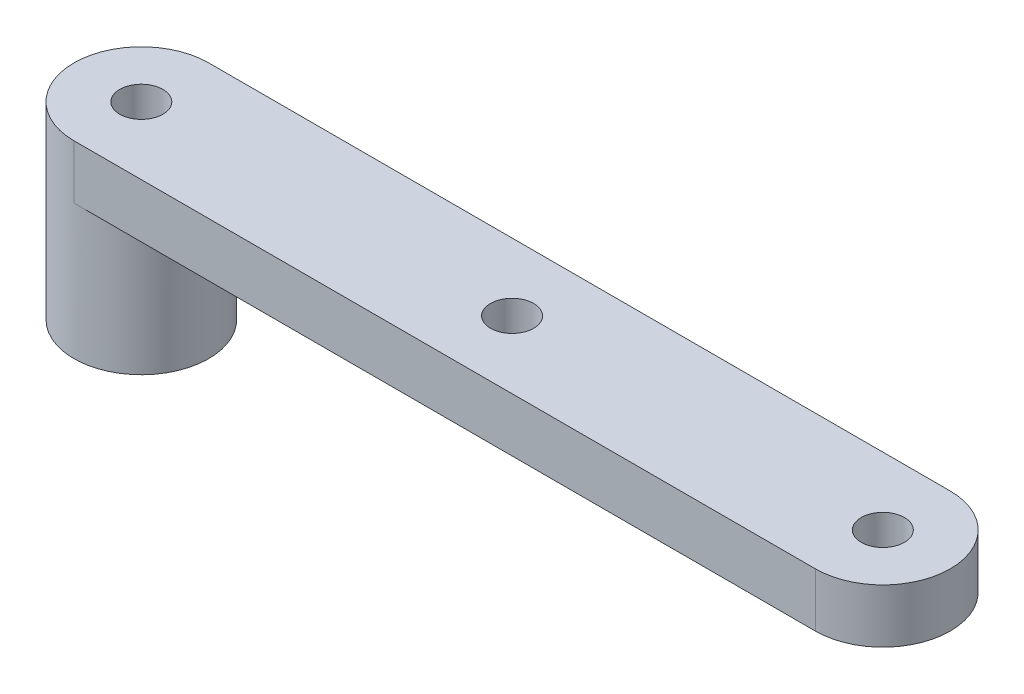
ISO-10303-21;
HEADER;
FILE_DESCRIPTION(('STEP AP214'),'2;1');
FILE_NAME('part.step','',(''),(''),'','','');
FILE_SCHEMA(('AUTOMOTIVE_DESIGN { 1 0 10303 214 1 1 1 1 }'));
ENDSEC;
DATA;
#1=APPLICATION_CONTEXT('core data for automotive mechanical design processes');
#2=APPLICATION_PROTOCOL_DEFINITION('international standard','automotive_design',2000,#1);
#3=PRODUCT_CONTEXT('',#1,'mechanical');
#4=PRODUCT('Part','Part','',(#3));
#5=PRODUCT_RELATED_PRODUCT_CATEGORY('part','',(#4));
#6=PRODUCT_DEFINITION_FORMATION('','',#4);
#7=PRODUCT_DEFINITION_CONTEXT('part definition',#1,'design');
#8=PRODUCT_DEFINITION('design','',#6,#7);
#9=PRODUCT_DEFINITION_SHAPE('','',#8);
#10=(LENGTH_UNIT() NAMED_UNIT(*) SI_UNIT(.MILLI.,.METRE.));
#11=(NAMED_UNIT(*) PLANE_ANGLE_UNIT() SI_UNIT($,.RADIAN.));
#12=(NAMED_UNIT(*) SI_UNIT($,.STERADIAN.) SOLID_ANGLE_UNIT());
#13=UNCERTAINTY_MEASURE_WITH_UNIT(LENGTH_MEASURE(1.E-05),#10,'distance_accuracy_value','');
#14=(GEOMETRIC_REPRESENTATION_CONTEXT(3) GLOBAL_UNCERTAINTY_ASSIGNED_CONTEXT((#13)) GLOBAL_UNIT_ASSIGNED_CONTEXT((#10,
#11,#12)) REPRESENTATION_CONTEXT('',''));
#15=CARTESIAN_POINT('',(0.,0.,0.));
#16=DIRECTION('',(0.,0.,1.));
#17=DIRECTION('',(1.,0.,0.));
#18=AXIS2_PLACEMENT_3D('',#15,#16,#17);
#19=CARTESIAN_POINT('',(0.,0.,0.));
#20=DIRECTION('',(0.,1.,0.));
#21=DIRECTION('',(0.,0.,1.));
#22=AXIS2_PLACEMENT_3D('',#19,#20,#21);
#23=PLANE('',#22);
#24=CARTESIAN_POINT('',(27.5,0.,0.));
#25=DIRECTION('',(0.,1.,0.));
#26=DIRECTION('',(0.,0.,1.));
#27=AXIS2_PLACEMENT_3D('',#24,#25,#26);
#28=CIRCLE('',#27,1.6);
#29=CARTESIAN_POINT('',(27.5,0.,1.6));
#30=VERTEX_POINT('',#29);
#31=EDGE_CURVE('E96',#30,#30,#28,.T.);
#32=ORIENTED_EDGE('',*,*,#31,.T.);
#33=EDGE_LOOP('',(#32));
#34=FACE_BOUND('',#33,.T.);
#35=CARTESIAN_POINT('',(55.,0.,0.));
#36=DIRECTION('',(0.,1.,0.));
#37=DIRECTION('',(0.,0.,1.));
#38=AXIS2_PLACEMENT_3D('',#35,#36,#37);
#39=CIRCLE('',#38,1.6);
#40=CARTESIAN_POINT('',(55.,0.,1.6));
#41=VERTEX_POINT('',#40);
#42=EDGE_CURVE('E134',#41,#41,#39,.T.);
#43=ORIENTED_EDGE('',*,*,#42,.T.);
#44=EDGE_LOOP('',(#43));
#45=FACE_BOUND('',#44,.T.);
#46=CARTESIAN_POINT('',(0.,0.,0.));
#47=DIRECTION('',(0.,-1.,0.));
#48=DIRECTION('',(0.,0.,-1.));
#49=AXIS2_PLACEMENT_3D('',#46,#47,#48);
#50=CIRCLE('',#49,5.);
#51=CARTESIAN_POINT('',(0.,0.,-5.));
#52=VERTEX_POINT('',#51);
#53=CARTESIAN_POINT('',(0.,0.,5.));
#54=VERTEX_POINT('',#53);
#55=EDGE_CURVE('E88',#52,#54,#50,.T.);
#56=ORIENTED_EDGE('',*,*,#55,.F.);
#57=DIRECTION('',(-1.,0.,0.));
#58=VECTOR('',#57,1.);
#59=CARTESIAN_POINT('',(0.,0.,-5.));
#60=LINE('',#59,#58);
#61=CARTESIAN_POINT('',(55.,0.,-5.));
#62=VERTEX_POINT('',#61);
#63=EDGE_CURVE('E90',#62,#52,#60,.T.);
#64=ORIENTED_EDGE('',*,*,#63,.F.);
#65=CARTESIAN_POINT('',(55.,0.,0.));
#66=DIRECTION('',(0.,1.,0.));
#67=DIRECTION('',(0.,0.,1.));
#68=AXIS2_PLACEMENT_3D('',#65,#66,#67);
#69=CIRCLE('',#68,5.);
#70=CARTESIAN_POINT('',(55.,0.,5.));
#71=VERTEX_POINT('',#70);
#72=EDGE_CURVE('E78',#71,#62,#69,.T.);
#73=ORIENTED_EDGE('',*,*,#72,.F.);
#74=DIRECTION('',(1.,0.,0.));
#75=VECTOR('',#74,1.);
#76=CARTESIAN_POINT('',(0.,0.,5.));
#77=LINE('',#76,#75);
#78=EDGE_CURVE('E71',#54,#71,#77,.T.);
#79=ORIENTED_EDGE('',*,*,#78,.F.);
#80=EDGE_LOOP('',(#56,#64,#73,#79));
#81=FACE_BOUND('',#80,.T.);
#82=ADVANCED_FACE('F39',(#34,#45,#81),#23,.F.);
#83=CARTESIAN_POINT('',(0.,4.,0.));
#84=DIRECTION('',(0.,-1.,0.));
#85=DIRECTION('',(0.,0.,-1.));
#86=AXIS2_PLACEMENT_3D('',#83,#84,#85);
#87=CYLINDRICAL_SURFACE('',#86,5.);
#88=DIRECTION('',(0.,-1.,0.));
#89=VECTOR('',#88,1.);
#90=CARTESIAN_POINT('',(0.,4.,-5.));
#91=LINE('',#90,#89);
#92=CARTESIAN_POINT('',(0.,4.,-5.));
#93=VERTEX_POINT('',#92);
#94=EDGE_CURVE('E100',#93,#52,#91,.T.);
#95=ORIENTED_EDGE('',*,*,#94,.T.);
#96=ORIENTED_EDGE('',*,*,#55,.T.);
#97=DIRECTION('',(0.,-1.,0.));
#98=VECTOR('',#97,1.);
#99=CARTESIAN_POINT('',(0.,4.,5.));
#100=LINE('',#99,#98);
#101=CARTESIAN_POINT('',(0.,4.,5.));
#102=VERTEX_POINT('',#101);
#103=EDGE_CURVE('E11',#102,#54,#100,.T.);
#104=ORIENTED_EDGE('',*,*,#103,.F.);
#105=CARTESIAN_POINT('',(0.,4.,0.));
#106=DIRECTION('',(0.,1.,0.));
#107=DIRECTION('',(0.,0.,1.));
#108=AXIS2_PLACEMENT_3D('',#105,#106,#107);
#109=CIRCLE('',#108,5.);
#110=EDGE_CURVE('E104',#93,#102,#109,.T.);
#111=ORIENTED_EDGE('',*,*,#110,.F.);
#112=EDGE_LOOP('',(#95,#96,#104,#111));
#113=FACE_BOUND('',#112,.T.);
#114=CARTESIAN_POINT('',(0.,-10.,0.));
#115=DIRECTION('',(0.,-1.,0.));
#116=DIRECTION('',(0.,0.,-1.));
#117=AXIS2_PLACEMENT_3D('',#114,#115,#116);
#118=CIRCLE('',#117,5.);
#119=CARTESIAN_POINT('',(0.,-10.,-5.));
#120=VERTEX_POINT('',#119);
#121=EDGE_CURVE('E95',#120,#120,#118,.T.);
#122=ORIENTED_EDGE('',*,*,#121,.F.);
#123=EDGE_LOOP('',(#122));
#124=FACE_BOUND('',#123,.T.);
#125=ADVANCED_FACE('F41',(#113,#124),#87,.T.);
#126=CARTESIAN_POINT('',(0.,4.,5.));
#127=DIRECTION('',(0.,0.,-1.));
#128=DIRECTION('',(-1.,0.,0.));
#129=AXIS2_PLACEMENT_3D('',#126,#127,#128);
#130=PLANE('',#129);
#131=ORIENTED_EDGE('',*,*,#78,.T.);
#132=DIRECTION('',(0.,-1.,0.));
#133=VECTOR('',#132,1.);
#134=CARTESIAN_POINT('',(55.,4.,5.));
#135=LINE('',#134,#133);
#136=CARTESIAN_POINT('',(55.,4.,5.));
#137=VERTEX_POINT('',#136);
#138=EDGE_CURVE('E49',#137,#71,#135,.T.);
#139=ORIENTED_EDGE('',*,*,#138,.F.);
#140=DIRECTION('',(1.,0.,0.));
#141=VECTOR('',#140,1.);
#142=CARTESIAN_POINT('',(0.,4.,5.));
#143=LINE('',#142,#141);
#144=EDGE_CURVE('E83',#102,#137,#143,.T.);
#145=ORIENTED_EDGE('',*,*,#144,.F.);
#146=ORIENTED_EDGE('',*,*,#103,.T.);
#147=EDGE_LOOP('',(#131,#139,#145,#146));
#148=FACE_BOUND('',#147,.T.);
#149=ADVANCED_FACE('F172',(#148),#130,.F.);
#150=CARTESIAN_POINT('',(55.,4.,0.));
#151=DIRECTION('',(0.,-1.,0.));
#152=DIRECTION('',(0.,0.,-1.));
#153=AXIS2_PLACEMENT_3D('',#150,#151,#152);
#154=CYLINDRICAL_SURFACE('',#153,5.);
#155=ORIENTED_EDGE('',*,*,#72,.T.);
#156=DIRECTION('',(0.,-1.,0.));
#157=VECTOR('',#156,1.);
#158=CARTESIAN_POINT('',(55.,4.,-5.));
#159=LINE('',#158,#157);
#160=CARTESIAN_POINT('',(55.,4.,-5.));
#161=VERTEX_POINT('',#160);
#162=EDGE_CURVE('E102',#161,#62,#159,.T.);
#163=ORIENTED_EDGE('',*,*,#162,.F.);
#164=CARTESIAN_POINT('',(55.,4.,0.));
#165=DIRECTION('',(0.,1.,0.));
#166=DIRECTION('',(0.,0.,1.));
#167=AXIS2_PLACEMENT_3D('',#164,#165,#166);
#168=CIRCLE('',#167,5.);
#169=EDGE_CURVE('E112',#137,#161,#168,.T.);
#170=ORIENTED_EDGE('',*,*,#169,.F.);
#171=ORIENTED_EDGE('',*,*,#138,.T.);
#172=EDGE_LOOP('',(#155,#163,#170,#171));
#173=FACE_BOUND('',#172,.T.);
#174=ADVANCED_FACE('F117',(#173),#154,.T.);
#175=CARTESIAN_POINT('',(0.,4.,-5.));
#176=DIRECTION('',(0.,0.,1.));
#177=DIRECTION('',(1.,0.,0.));
#178=AXIS2_PLACEMENT_3D('',#175,#176,#177);
#179=PLANE('',#178);
#180=ORIENTED_EDGE('',*,*,#63,.T.);
#181=ORIENTED_EDGE('',*,*,#94,.F.);
#182=DIRECTION('',(-1.,0.,0.));
#183=VECTOR('',#182,1.);
#184=CARTESIAN_POINT('',(0.,4.,-5.));
#185=LINE('',#184,#183);
#186=EDGE_CURVE('E57',#161,#93,#185,.T.);
#187=ORIENTED_EDGE('',*,*,#186,.F.);
#188=ORIENTED_EDGE('',*,*,#162,.T.);
#189=EDGE_LOOP('',(#180,#181,#187,#188));
#190=FACE_BOUND('',#189,.T.);
#191=ADVANCED_FACE('F99',(#190),#179,.F.);
#192=CARTESIAN_POINT('',(0.,4.,0.));
#193=DIRECTION('',(0.,1.,0.));
#194=DIRECTION('',(0.,0.,1.));
#195=AXIS2_PLACEMENT_3D('',#192,#193,#194);
#196=PLANE('',#195);
#197=CARTESIAN_POINT('',(0.,4.,0.));
#198=DIRECTION('',(0.,1.,0.));
#199=DIRECTION('',(0.,0.,1.));
#200=AXIS2_PLACEMENT_3D('',#197,#198,#199);
#201=CIRCLE('',#200,1.6);
#202=CARTESIAN_POINT('',(0.,4.,1.6));
#203=VERTEX_POINT('',#202);
#204=EDGE_CURVE('E147',#203,#203,#201,.T.);
#205=ORIENTED_EDGE('',*,*,#204,.F.);
#206=EDGE_LOOP('',(#205));
#207=FACE_BOUND('',#206,.T.);
#208=CARTESIAN_POINT('',(27.5,4.,0.));
#209=DIRECTION('',(0.,1.,0.));
#210=DIRECTION('',(0.,0.,1.));
#211=AXIS2_PLACEMENT_3D('',#208,#209,#210);
#212=CIRCLE('',#211,1.6);
#213=CARTESIAN_POINT('',(27.5,4.,1.6));
#214=VERTEX_POINT('',#213);
#215=EDGE_CURVE('E143',#214,#214,#212,.T.);
#216=ORIENTED_EDGE('',*,*,#215,.F.);
#217=EDGE_LOOP('',(#216));
#218=FACE_BOUND('',#217,.T.);
#219=CARTESIAN_POINT('',(55.,4.,0.));
#220=DIRECTION('',(0.,1.,0.));
#221=DIRECTION('',(0.,0.,1.));
#222=AXIS2_PLACEMENT_3D('',#219,#220,#221);
#223=CIRCLE('',#222,1.6);
#224=CARTESIAN_POINT('',(55.,4.,1.6));
#225=VERTEX_POINT('',#224);
#226=EDGE_CURVE('E139',#225,#225,#223,.T.);
#227=ORIENTED_EDGE('',*,*,#226,.F.);
#228=EDGE_LOOP('',(#227));
#229=FACE_BOUND('',#228,.T.);
#230=ORIENTED_EDGE('',*,*,#110,.T.);
#231=ORIENTED_EDGE('',*,*,#144,.T.);
#232=ORIENTED_EDGE('',*,*,#169,.T.);
#233=ORIENTED_EDGE('',*,*,#186,.T.);
#234=EDGE_LOOP('',(#230,#231,#232,#233));
#235=FACE_BOUND('',#234,.T.);
#236=ADVANCED_FACE('F165',(#207,#218,#229,#235),#196,.T.);
#237=CARTESIAN_POINT('',(0.,-10.,0.));
#238=DIRECTION('',(0.,-1.,0.));
#239=DIRECTION('',(0.,0.,-1.));
#240=AXIS2_PLACEMENT_3D('',#237,#238,#239);
#241=PLANE('',#240);
#242=CARTESIAN_POINT('',(0.,-10.,0.));
#243=DIRECTION('',(0.,1.,0.));
#244=DIRECTION('',(0.,0.,1.));
#245=AXIS2_PLACEMENT_3D('',#242,#243,#244);
#246=CIRCLE('',#245,1.6);
#247=CARTESIAN_POINT('',(0.,-10.,1.6));
#248=VERTEX_POINT('',#247);
#249=EDGE_CURVE('E138',#248,#248,#246,.T.);
#250=ORIENTED_EDGE('',*,*,#249,.T.);
#251=EDGE_LOOP('',(#250));
#252=FACE_BOUND('',#251,.T.);
#253=ORIENTED_EDGE('',*,*,#121,.T.);
#254=EDGE_LOOP('',(#253));
#255=FACE_BOUND('',#254,.T.);
#256=ADVANCED_FACE('F155',(#252,#255),#241,.T.);
#257=CARTESIAN_POINT('',(0.,-10.,0.));
#258=DIRECTION('',(0.,1.,0.));
#259=DIRECTION('',(0.,0.,1.));
#260=AXIS2_PLACEMENT_3D('',#257,#258,#259);
#261=CYLINDRICAL_SURFACE('',#260,1.6);
#262=ORIENTED_EDGE('',*,*,#249,.F.);
#263=EDGE_LOOP('',(#262));
#264=FACE_BOUND('',#263,.T.);
#265=ORIENTED_EDGE('',*,*,#204,.T.);
#266=EDGE_LOOP('',(#265));
#267=FACE_BOUND('',#266,.T.);
#268=ADVANCED_FACE('F158',(#264,#267),#261,.F.);
#269=CARTESIAN_POINT('',(55.,-10.,0.));
#270=DIRECTION('',(0.,1.,0.));
#271=DIRECTION('',(0.,0.,1.));
#272=AXIS2_PLACEMENT_3D('',#269,#270,#271);
#273=CYLINDRICAL_SURFACE('',#272,1.6);
#274=ORIENTED_EDGE('',*,*,#226,.T.);
#275=EDGE_LOOP('',(#274));
#276=FACE_BOUND('',#275,.T.);
#277=ORIENTED_EDGE('',*,*,#42,.F.);
#278=EDGE_LOOP('',(#277));
#279=FACE_BOUND('',#278,.T.);
#280=ADVANCED_FACE('F161',(#276,#279),#273,.F.);
#281=CARTESIAN_POINT('',(27.5,-10.,0.));
#282=DIRECTION('',(0.,1.,0.));
#283=DIRECTION('',(0.,0.,1.));
#284=AXIS2_PLACEMENT_3D('',#281,#282,#283);
#285=CYLINDRICAL_SURFACE('',#284,1.6);
#286=ORIENTED_EDGE('',*,*,#215,.T.);
#287=EDGE_LOOP('',(#286));
#288=FACE_BOUND('',#287,.T.);
#289=ORIENTED_EDGE('',*,*,#31,.F.);
#290=EDGE_LOOP('',(#289));
#291=FACE_BOUND('',#290,.T.);
#292=ADVANCED_FACE('F211',(#288,#291),#285,.F.);
#293=CLOSED_SHELL('',(#82,#125,#149,#174,#191,#236,#256,#268,#280,#292));
#294=MANIFOLD_SOLID_BREP('B2',#293);
#295=ADVANCED_BREP_SHAPE_REPRESENTATION('',(#18,#294),#14);
#296=SHAPE_DEFINITION_REPRESENTATION(#9,#295);
ENDSEC;
END-ISO-10303-21;
